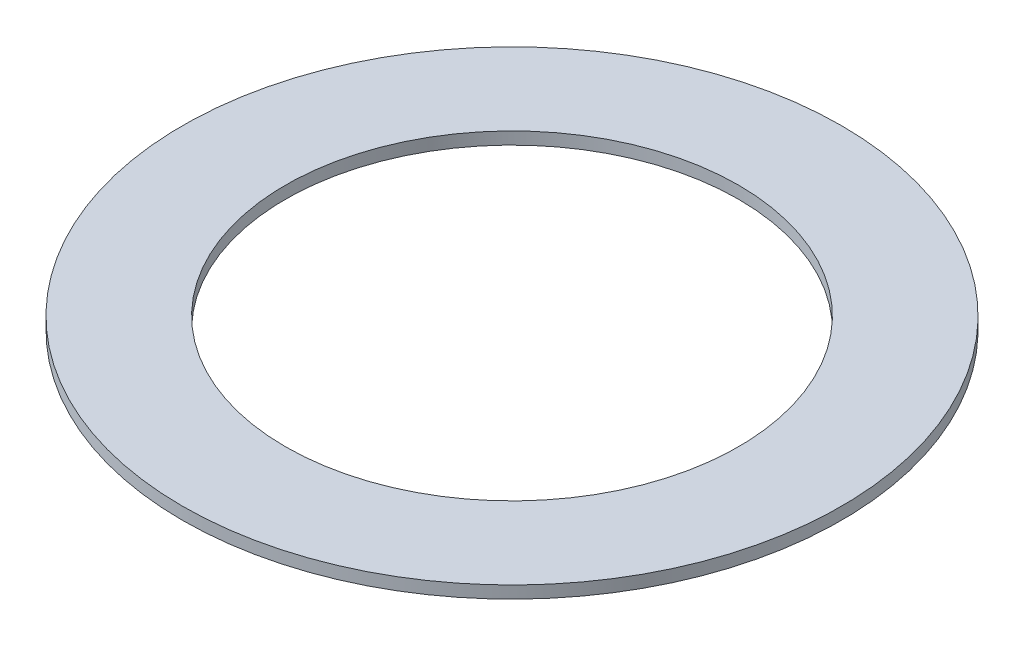
ISO-10303-21;
HEADER;
FILE_DESCRIPTION(('STEP AP214'),'2;1');
FILE_NAME('part.step','',(''),(''),'','','');
FILE_SCHEMA(('AUTOMOTIVE_DESIGN { 1 0 10303 214 1 1 1 1 }'));
ENDSEC;
DATA;
#1=APPLICATION_CONTEXT('core data for automotive mechanical design processes');
#2=APPLICATION_PROTOCOL_DEFINITION('international standard','automotive_design',2000,#1);
#3=PRODUCT_CONTEXT('',#1,'mechanical');
#4=PRODUCT('Part','Part','',(#3));
#5=PRODUCT_RELATED_PRODUCT_CATEGORY('part','',(#4));
#6=PRODUCT_DEFINITION_FORMATION('','',#4);
#7=PRODUCT_DEFINITION_CONTEXT('part definition',#1,'design');
#8=PRODUCT_DEFINITION('design','',#6,#7);
#9=PRODUCT_DEFINITION_SHAPE('','',#8);
#10=(LENGTH_UNIT() NAMED_UNIT(*) SI_UNIT(.MILLI.,.METRE.));
#11=(NAMED_UNIT(*) PLANE_ANGLE_UNIT() SI_UNIT($,.RADIAN.));
#12=(NAMED_UNIT(*) SI_UNIT($,.STERADIAN.) SOLID_ANGLE_UNIT());
#13=UNCERTAINTY_MEASURE_WITH_UNIT(LENGTH_MEASURE(1.E-05),#10,'distance_accuracy_value','');
#14=(GEOMETRIC_REPRESENTATION_CONTEXT(3) GLOBAL_UNCERTAINTY_ASSIGNED_CONTEXT((#13)) GLOBAL_UNIT_ASSIGNED_CONTEXT((#10,
#11,#12)) REPRESENTATION_CONTEXT('',''));
#15=CARTESIAN_POINT('',(0.,0.,0.));
#16=DIRECTION('',(0.,0.,1.));
#17=DIRECTION('',(1.,0.,0.));
#18=AXIS2_PLACEMENT_3D('',#15,#16,#17);
#19=CARTESIAN_POINT('',(0.,0.3556,0.));
#20=DIRECTION('',(0.,1.,0.));
#21=DIRECTION('',(0.,0.,1.));
#22=AXIS2_PLACEMENT_3D('',#19,#20,#21);
#23=PLANE('',#22);
#24=CARTESIAN_POINT('',(0.,0.3556,0.));
#25=DIRECTION('',(0.,1.,0.));
#26=DIRECTION('',(0.,0.,1.));
#27=AXIS2_PLACEMENT_3D('',#24,#25,#26);
#28=CIRCLE('',#27,9.5504);
#29=CARTESIAN_POINT('',(0.,0.3556,9.5504));
#30=VERTEX_POINT('',#29);
#31=EDGE_CURVE('E10',#30,#30,#28,.T.);
#32=ORIENTED_EDGE('',*,*,#31,.T.);
#33=EDGE_LOOP('',(#32));
#34=FACE_BOUND('',#33,.T.);
#35=CARTESIAN_POINT('',(0.,0.3556,0.));
#36=DIRECTION('',(0.,1.,0.));
#37=DIRECTION('',(0.,0.,1.));
#38=AXIS2_PLACEMENT_3D('',#35,#36,#37);
#39=CIRCLE('',#38,6.5659);
#40=CARTESIAN_POINT('',(0.,0.3556,6.5659));
#41=VERTEX_POINT('',#40);
#42=EDGE_CURVE('E41',#41,#41,#39,.T.);
#43=ORIENTED_EDGE('',*,*,#42,.F.);
#44=EDGE_LOOP('',(#43));
#45=FACE_BOUND('',#44,.T.);
#46=ADVANCED_FACE('F30',(#34,#45),#23,.T.);
#47=CARTESIAN_POINT('',(0.,0.,0.));
#48=DIRECTION('',(0.,1.,0.));
#49=DIRECTION('',(0.,0.,1.));
#50=AXIS2_PLACEMENT_3D('',#47,#48,#49);
#51=PLANE('',#50);
#52=CARTESIAN_POINT('',(0.,0.,0.));
#53=DIRECTION('',(0.,1.,0.));
#54=DIRECTION('',(0.,0.,1.));
#55=AXIS2_PLACEMENT_3D('',#52,#53,#54);
#56=CIRCLE('',#55,9.5504);
#57=CARTESIAN_POINT('',(0.,0.,9.5504));
#58=VERTEX_POINT('',#57);
#59=EDGE_CURVE('E34',#58,#58,#56,.T.);
#60=ORIENTED_EDGE('',*,*,#59,.F.);
#61=EDGE_LOOP('',(#60));
#62=FACE_BOUND('',#61,.T.);
#63=CARTESIAN_POINT('',(0.,0.,0.));
#64=DIRECTION('',(0.,1.,0.));
#65=DIRECTION('',(0.,0.,1.));
#66=AXIS2_PLACEMENT_3D('',#63,#64,#65);
#67=CIRCLE('',#66,6.5659);
#68=CARTESIAN_POINT('',(0.,0.,6.5659));
#69=VERTEX_POINT('',#68);
#70=EDGE_CURVE('E43',#69,#69,#67,.T.);
#71=ORIENTED_EDGE('',*,*,#70,.T.);
#72=EDGE_LOOP('',(#71));
#73=FACE_BOUND('',#72,.T.);
#74=ADVANCED_FACE('F53',(#62,#73),#51,.F.);
#75=CARTESIAN_POINT('',(0.,0.3556,0.));
#76=DIRECTION('',(0.,-1.,0.));
#77=DIRECTION('',(0.,0.,-1.));
#78=AXIS2_PLACEMENT_3D('',#75,#76,#77);
#79=CYLINDRICAL_SURFACE('',#78,9.5504);
#80=ORIENTED_EDGE('',*,*,#31,.F.);
#81=EDGE_LOOP('',(#80));
#82=FACE_BOUND('',#81,.T.);
#83=ORIENTED_EDGE('',*,*,#59,.T.);
#84=EDGE_LOOP('',(#83));
#85=FACE_BOUND('',#84,.T.);
#86=ADVANCED_FACE('F32',(#82,#85),#79,.T.);
#87=CARTESIAN_POINT('',(0.,0.3556,0.));
#88=DIRECTION('',(0.,-1.,0.));
#89=DIRECTION('',(0.,0.,-1.));
#90=AXIS2_PLACEMENT_3D('',#87,#88,#89);
#91=CYLINDRICAL_SURFACE('',#90,6.5659);
#92=ORIENTED_EDGE('',*,*,#42,.T.);
#93=EDGE_LOOP('',(#92));
#94=FACE_BOUND('',#93,.T.);
#95=ORIENTED_EDGE('',*,*,#70,.F.);
#96=EDGE_LOOP('',(#95));
#97=FACE_BOUND('',#96,.T.);
#98=ADVANCED_FACE('F49',(#94,#97),#91,.F.);
#99=CLOSED_SHELL('',(#46,#74,#86,#98));
#100=MANIFOLD_SOLID_BREP('B2',#99);
#101=ADVANCED_BREP_SHAPE_REPRESENTATION('',(#18,#100),#14);
#102=SHAPE_DEFINITION_REPRESENTATION(#9,#101);
ENDSEC;
END-ISO-10303-21;
